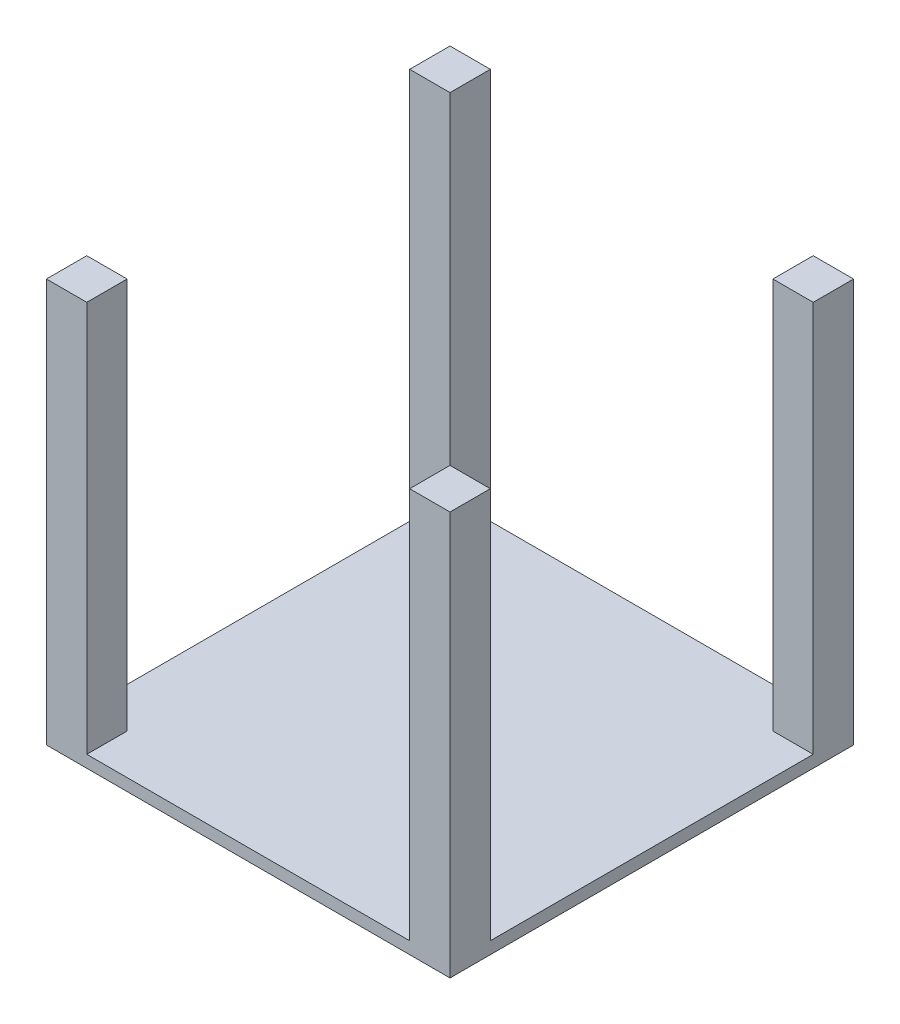
ISO-10303-21;
HEADER;
FILE_DESCRIPTION(('STEP AP214'),'2;1');
FILE_NAME('part.step','',(''),(''),'','','');
FILE_SCHEMA(('AUTOMOTIVE_DESIGN { 1 0 10303 214 1 1 1 1 }'));
ENDSEC;
DATA;
#1=APPLICATION_CONTEXT('core data for automotive mechanical design processes');
#2=APPLICATION_PROTOCOL_DEFINITION('international standard','automotive_design',2000,#1);
#3=PRODUCT_CONTEXT('',#1,'mechanical');
#4=PRODUCT('Part','Part','',(#3));
#5=PRODUCT_RELATED_PRODUCT_CATEGORY('part','',(#4));
#6=PRODUCT_DEFINITION_FORMATION('','',#4);
#7=PRODUCT_DEFINITION_CONTEXT('part definition',#1,'design');
#8=PRODUCT_DEFINITION('design','',#6,#7);
#9=PRODUCT_DEFINITION_SHAPE('','',#8);
#10=(LENGTH_UNIT() NAMED_UNIT(*) SI_UNIT(.MILLI.,.METRE.));
#11=(NAMED_UNIT(*) PLANE_ANGLE_UNIT() SI_UNIT($,.RADIAN.));
#12=(NAMED_UNIT(*) SI_UNIT($,.STERADIAN.) SOLID_ANGLE_UNIT());
#13=UNCERTAINTY_MEASURE_WITH_UNIT(LENGTH_MEASURE(1.E-05),#10,'distance_accuracy_value','');
#14=(GEOMETRIC_REPRESENTATION_CONTEXT(3) GLOBAL_UNCERTAINTY_ASSIGNED_CONTEXT((#13)) GLOBAL_UNIT_ASSIGNED_CONTEXT((#10,
#11,#12)) REPRESENTATION_CONTEXT('',''));
#15=CARTESIAN_POINT('',(0.,0.,0.));
#16=DIRECTION('',(0.,0.,1.));
#17=DIRECTION('',(1.,0.,0.));
#18=AXIS2_PLACEMENT_3D('',#15,#16,#17);
#19=CARTESIAN_POINT('',(0.,30.,500.));
#20=DIRECTION('',(0.,0.,1.));
#21=DIRECTION('',(1.,0.,0.));
#22=AXIS2_PLACEMENT_3D('',#19,#20,#21);
#23=PLANE('',#22);
#24=DIRECTION('',(-1.,0.,0.));
#25=VECTOR('',#24,1.);
#26=CARTESIAN_POINT('',(0.,0.,500.));
#27=LINE('',#26,#25);
#28=CARTESIAN_POINT('',(500.,0.,500.));
#29=VERTEX_POINT('',#28);
#30=CARTESIAN_POINT('',(-500.,0.,500.));
#31=VERTEX_POINT('',#30);
#32=EDGE_CURVE('E157',#29,#31,#27,.T.);
#33=ORIENTED_EDGE('',*,*,#32,.F.);
#34=DIRECTION('',(0.,-1.,0.));
#35=VECTOR('',#34,1.);
#36=CARTESIAN_POINT('',(500.,1000.,500.));
#37=LINE('',#36,#35);
#38=CARTESIAN_POINT('',(500.,1000.,500.));
#39=VERTEX_POINT('',#38);
#40=EDGE_CURVE('E169',#39,#29,#37,.T.);
#41=ORIENTED_EDGE('',*,*,#40,.F.);
#42=DIRECTION('',(-1.,0.,0.));
#43=VECTOR('',#42,1.);
#44=CARTESIAN_POINT('',(500.,1000.,500.));
#45=LINE('',#44,#43);
#46=CARTESIAN_POINT('',(400.,1000.,500.));
#47=VERTEX_POINT('',#46);
#48=EDGE_CURVE('E199',#39,#47,#45,.T.);
#49=ORIENTED_EDGE('',*,*,#48,.T.);
#50=DIRECTION('',(0.,-1.,0.));
#51=VECTOR('',#50,1.);
#52=CARTESIAN_POINT('',(400.,1000.,500.));
#53=LINE('',#52,#51);
#54=CARTESIAN_POINT('',(400.,30.,500.));
#55=VERTEX_POINT('',#54);
#56=EDGE_CURVE('E192',#47,#55,#53,.T.);
#57=ORIENTED_EDGE('',*,*,#56,.T.);
#58=DIRECTION('',(-1.,0.,0.));
#59=VECTOR('',#58,1.);
#60=CARTESIAN_POINT('',(0.,30.,500.));
#61=LINE('',#60,#59);
#62=CARTESIAN_POINT('',(-400.,30.,500.));
#63=VERTEX_POINT('',#62);
#64=EDGE_CURVE('E290',#55,#63,#61,.T.);
#65=ORIENTED_EDGE('',*,*,#64,.T.);
#66=DIRECTION('',(0.,-1.,0.));
#67=VECTOR('',#66,1.);
#68=CARTESIAN_POINT('',(-400.,1000.,500.));
#69=LINE('',#68,#67);
#70=CARTESIAN_POINT('',(-400.,1000.,500.));
#71=VERTEX_POINT('',#70);
#72=EDGE_CURVE('E174',#71,#63,#69,.T.);
#73=ORIENTED_EDGE('',*,*,#72,.F.);
#74=DIRECTION('',(-1.,0.,0.));
#75=VECTOR('',#74,1.);
#76=CARTESIAN_POINT('',(0.,1000.,500.));
#77=LINE('',#76,#75);
#78=CARTESIAN_POINT('',(-500.,1000.,500.));
#79=VERTEX_POINT('',#78);
#80=EDGE_CURVE('E260',#71,#79,#77,.T.);
#81=ORIENTED_EDGE('',*,*,#80,.T.);
#82=DIRECTION('',(0.,-1.,0.));
#83=VECTOR('',#82,1.);
#84=CARTESIAN_POINT('',(-500.,1000.,500.));
#85=LINE('',#84,#83);
#86=EDGE_CURVE('E172',#79,#31,#85,.T.);
#87=ORIENTED_EDGE('',*,*,#86,.T.);
#88=EDGE_LOOP('',(#33,#41,#49,#57,#65,#73,#81,#87));
#89=FACE_BOUND('',#88,.T.);
#90=ADVANCED_FACE('F43',(#89),#23,.T.);
#91=CARTESIAN_POINT('',(500.,30.,0.));
#92=DIRECTION('',(-1.,0.,0.));
#93=DIRECTION('',(0.,0.,1.));
#94=AXIS2_PLACEMENT_3D('',#91,#92,#93);
#95=PLANE('',#94);
#96=DIRECTION('',(0.,0.,-1.));
#97=VECTOR('',#96,1.);
#98=CARTESIAN_POINT('',(500.,0.,0.));
#99=LINE('',#98,#97);
#100=CARTESIAN_POINT('',(500.,0.,-500.));
#101=VERTEX_POINT('',#100);
#102=EDGE_CURVE('E153',#29,#101,#99,.T.);
#103=ORIENTED_EDGE('',*,*,#102,.T.);
#104=DIRECTION('',(0.,-1.,0.));
#105=VECTOR('',#104,1.);
#106=CARTESIAN_POINT('',(500.,1000.,-500.));
#107=LINE('',#106,#105);
#108=CARTESIAN_POINT('',(500.,1000.,-500.));
#109=VERTEX_POINT('',#108);
#110=EDGE_CURVE('E214',#109,#101,#107,.T.);
#111=ORIENTED_EDGE('',*,*,#110,.F.);
#112=DIRECTION('',(0.,0.,-1.));
#113=VECTOR('',#112,1.);
#114=CARTESIAN_POINT('',(500.,1000.,0.));
#115=LINE('',#114,#113);
#116=CARTESIAN_POINT('',(500.,1000.,-400.));
#117=VERTEX_POINT('',#116);
#118=EDGE_CURVE('E217',#117,#109,#115,.T.);
#119=ORIENTED_EDGE('',*,*,#118,.F.);
#120=DIRECTION('',(0.,-1.,0.));
#121=VECTOR('',#120,1.);
#122=CARTESIAN_POINT('',(500.,1000.,-400.));
#123=LINE('',#122,#121);
#124=CARTESIAN_POINT('',(500.,30.,-400.));
#125=VERTEX_POINT('',#124);
#126=EDGE_CURVE('E210',#117,#125,#123,.T.);
#127=ORIENTED_EDGE('',*,*,#126,.T.);
#128=DIRECTION('',(0.,0.,-1.));
#129=VECTOR('',#128,1.);
#130=CARTESIAN_POINT('',(500.,30.,0.));
#131=LINE('',#130,#129);
#132=CARTESIAN_POINT('',(500.,30.,400.));
#133=VERTEX_POINT('',#132);
#134=EDGE_CURVE('E301',#133,#125,#131,.T.);
#135=ORIENTED_EDGE('',*,*,#134,.F.);
#136=DIRECTION('',(0.,-1.,0.));
#137=VECTOR('',#136,1.);
#138=CARTESIAN_POINT('',(500.,1000.,400.));
#139=LINE('',#138,#137);
#140=CARTESIAN_POINT('',(500.,1000.,400.));
#141=VERTEX_POINT('',#140);
#142=EDGE_CURVE('E181',#141,#133,#139,.T.);
#143=ORIENTED_EDGE('',*,*,#142,.F.);
#144=DIRECTION('',(0.,0.,-1.));
#145=VECTOR('',#144,1.);
#146=CARTESIAN_POINT('',(500.,1000.,500.));
#147=LINE('',#146,#145);
#148=EDGE_CURVE('E178',#39,#141,#147,.T.);
#149=ORIENTED_EDGE('',*,*,#148,.F.);
#150=ORIENTED_EDGE('',*,*,#40,.T.);
#151=EDGE_LOOP('',(#103,#111,#119,#127,#135,#143,#149,#150));
#152=FACE_BOUND('',#151,.T.);
#153=ADVANCED_FACE('F176',(#152),#95,.F.);
#154=CARTESIAN_POINT('',(0.,30.,-500.));
#155=DIRECTION('',(0.,0.,1.));
#156=DIRECTION('',(1.,0.,0.));
#157=AXIS2_PLACEMENT_3D('',#154,#155,#156);
#158=PLANE('',#157);
#159=DIRECTION('',(-1.,0.,0.));
#160=VECTOR('',#159,1.);
#161=CARTESIAN_POINT('',(0.,0.,-500.));
#162=LINE('',#161,#160);
#163=CARTESIAN_POINT('',(-500.,0.,-500.));
#164=VERTEX_POINT('',#163);
#165=EDGE_CURVE('E159',#101,#164,#162,.T.);
#166=ORIENTED_EDGE('',*,*,#165,.T.);
#167=DIRECTION('',(0.,-1.,0.));
#168=VECTOR('',#167,1.);
#169=CARTESIAN_POINT('',(-500.,1000.,-500.));
#170=LINE('',#169,#168);
#171=CARTESIAN_POINT('',(-500.,1000.,-500.));
#172=VERTEX_POINT('',#171);
#173=EDGE_CURVE('E235',#172,#164,#170,.T.);
#174=ORIENTED_EDGE('',*,*,#173,.F.);
#175=DIRECTION('',(-1.,0.,0.));
#176=VECTOR('',#175,1.);
#177=CARTESIAN_POINT('',(0.,1000.,-500.));
#178=LINE('',#177,#176);
#179=CARTESIAN_POINT('',(-400.,1000.,-500.));
#180=VERTEX_POINT('',#179);
#181=EDGE_CURVE('E253',#180,#172,#178,.T.);
#182=ORIENTED_EDGE('',*,*,#181,.F.);
#183=DIRECTION('',(0.,-1.,0.));
#184=VECTOR('',#183,1.);
#185=CARTESIAN_POINT('',(-400.,1000.,-500.));
#186=LINE('',#185,#184);
#187=CARTESIAN_POINT('',(-400.,30.,-500.));
#188=VERTEX_POINT('',#187);
#189=EDGE_CURVE('E231',#180,#188,#186,.T.);
#190=ORIENTED_EDGE('',*,*,#189,.T.);
#191=DIRECTION('',(-1.,0.,0.));
#192=VECTOR('',#191,1.);
#193=CARTESIAN_POINT('',(0.,30.,-500.));
#194=LINE('',#193,#192);
#195=CARTESIAN_POINT('',(400.,30.,-500.));
#196=VERTEX_POINT('',#195);
#197=EDGE_CURVE('E311',#196,#188,#194,.T.);
#198=ORIENTED_EDGE('',*,*,#197,.F.);
#199=DIRECTION('',(0.,-1.,0.));
#200=VECTOR('',#199,1.);
#201=CARTESIAN_POINT('',(400.,1000.,-500.));
#202=LINE('',#201,#200);
#203=CARTESIAN_POINT('',(400.,1000.,-500.));
#204=VERTEX_POINT('',#203);
#205=EDGE_CURVE('E202',#204,#196,#202,.T.);
#206=ORIENTED_EDGE('',*,*,#205,.F.);
#207=DIRECTION('',(-1.,0.,0.));
#208=VECTOR('',#207,1.);
#209=CARTESIAN_POINT('',(0.,1000.,-500.));
#210=LINE('',#209,#208);
#211=EDGE_CURVE('E227',#109,#204,#210,.T.);
#212=ORIENTED_EDGE('',*,*,#211,.F.);
#213=ORIENTED_EDGE('',*,*,#110,.T.);
#214=EDGE_LOOP('',(#166,#174,#182,#190,#198,#206,#212,#213));
#215=FACE_BOUND('',#214,.T.);
#216=ADVANCED_FACE('F331',(#215),#158,.F.);
#217=CARTESIAN_POINT('',(-500.,30.,0.));
#218=DIRECTION('',(-1.,0.,0.));
#219=DIRECTION('',(0.,0.,1.));
#220=AXIS2_PLACEMENT_3D('',#217,#218,#219);
#221=PLANE('',#220);
#222=DIRECTION('',(0.,0.,-1.));
#223=VECTOR('',#222,1.);
#224=CARTESIAN_POINT('',(-500.,0.,0.));
#225=LINE('',#224,#223);
#226=EDGE_CURVE('E46',#31,#164,#225,.T.);
#227=ORIENTED_EDGE('',*,*,#226,.F.);
#228=ORIENTED_EDGE('',*,*,#86,.F.);
#229=DIRECTION('',(0.,0.,-1.));
#230=VECTOR('',#229,1.);
#231=CARTESIAN_POINT('',(-500.,1000.,0.));
#232=LINE('',#231,#230);
#233=CARTESIAN_POINT('',(-500.,1000.,400.));
#234=VERTEX_POINT('',#233);
#235=EDGE_CURVE('E270',#79,#234,#232,.T.);
#236=ORIENTED_EDGE('',*,*,#235,.T.);
#237=DIRECTION('',(0.,-1.,0.));
#238=VECTOR('',#237,1.);
#239=CARTESIAN_POINT('',(-500.,1000.,400.));
#240=LINE('',#239,#238);
#241=CARTESIAN_POINT('',(-500.,30.,400.));
#242=VERTEX_POINT('',#241);
#243=EDGE_CURVE('E276',#234,#242,#240,.T.);
#244=ORIENTED_EDGE('',*,*,#243,.T.);
#245=DIRECTION('',(0.,0.,-1.));
#246=VECTOR('',#245,1.);
#247=CARTESIAN_POINT('',(-500.,30.,0.));
#248=LINE('',#247,#246);
#249=CARTESIAN_POINT('',(-500.,30.,-400.));
#250=VERTEX_POINT('',#249);
#251=EDGE_CURVE('E52',#242,#250,#248,.T.);
#252=ORIENTED_EDGE('',*,*,#251,.T.);
#253=DIRECTION('',(0.,-1.,0.));
#254=VECTOR('',#253,1.);
#255=CARTESIAN_POINT('',(-500.,1000.,-400.));
#256=LINE('',#255,#254);
#257=CARTESIAN_POINT('',(-500.,1000.,-400.));
#258=VERTEX_POINT('',#257);
#259=EDGE_CURVE('E239',#258,#250,#256,.T.);
#260=ORIENTED_EDGE('',*,*,#259,.F.);
#261=DIRECTION('',(0.,0.,-1.));
#262=VECTOR('',#261,1.);
#263=CARTESIAN_POINT('',(-500.,1000.,0.));
#264=LINE('',#263,#262);
#265=EDGE_CURVE('E249',#258,#172,#264,.T.);
#266=ORIENTED_EDGE('',*,*,#265,.T.);
#267=ORIENTED_EDGE('',*,*,#173,.T.);
#268=EDGE_LOOP('',(#227,#228,#236,#244,#252,#260,#266,#267));
#269=FACE_BOUND('',#268,.T.);
#270=ADVANCED_FACE('F328',(#269),#221,.T.);
#271=CARTESIAN_POINT('',(0.,30.,0.));
#272=DIRECTION('',(0.,1.,0.));
#273=DIRECTION('',(0.,0.,1.));
#274=AXIS2_PLACEMENT_3D('',#271,#272,#273);
#275=PLANE('',#274);
#276=DIRECTION('',(0.,0.,-1.));
#277=VECTOR('',#276,1.);
#278=CARTESIAN_POINT('',(-400.,30.,4.44089209850063E-13));
#279=LINE('',#278,#277);
#280=CARTESIAN_POINT('',(-400.,30.,400.));
#281=VERTEX_POINT('',#280);
#282=EDGE_CURVE('E287',#63,#281,#279,.T.);
#283=ORIENTED_EDGE('',*,*,#282,.F.);
#284=ORIENTED_EDGE('',*,*,#64,.F.);
#285=DIRECTION('',(0.,0.,-1.));
#286=VECTOR('',#285,1.);
#287=CARTESIAN_POINT('',(400.,30.,0.));
#288=LINE('',#287,#286);
#289=CARTESIAN_POINT('',(400.,30.,400.));
#290=VERTEX_POINT('',#289);
#291=EDGE_CURVE('E294',#55,#290,#288,.T.);
#292=ORIENTED_EDGE('',*,*,#291,.T.);
#293=DIRECTION('',(-1.,0.,0.));
#294=VECTOR('',#293,1.);
#295=CARTESIAN_POINT('',(0.,30.,400.));
#296=LINE('',#295,#294);
#297=EDGE_CURVE('E297',#133,#290,#296,.T.);
#298=ORIENTED_EDGE('',*,*,#297,.F.);
#299=ORIENTED_EDGE('',*,*,#134,.T.);
#300=DIRECTION('',(-1.,0.,0.));
#301=VECTOR('',#300,1.);
#302=CARTESIAN_POINT('',(0.,30.,-400.));
#303=LINE('',#302,#301);
#304=CARTESIAN_POINT('',(400.,30.,-400.));
#305=VERTEX_POINT('',#304);
#306=EDGE_CURVE('E304',#125,#305,#303,.T.);
#307=ORIENTED_EDGE('',*,*,#306,.T.);
#308=DIRECTION('',(0.,0.,1.));
#309=VECTOR('',#308,1.);
#310=CARTESIAN_POINT('',(400.,30.,-2.22044604925031E-13));
#311=LINE('',#310,#309);
#312=EDGE_CURVE('E307',#196,#305,#311,.T.);
#313=ORIENTED_EDGE('',*,*,#312,.F.);
#314=ORIENTED_EDGE('',*,*,#197,.T.);
#315=DIRECTION('',(0.,0.,1.));
#316=VECTOR('',#315,1.);
#317=CARTESIAN_POINT('',(-400.,30.,0.));
#318=LINE('',#317,#316);
#319=CARTESIAN_POINT('',(-400.,30.,-400.));
#320=VERTEX_POINT('',#319);
#321=EDGE_CURVE('E315',#188,#320,#318,.T.);
#322=ORIENTED_EDGE('',*,*,#321,.T.);
#323=DIRECTION('',(1.,0.,0.));
#324=VECTOR('',#323,1.);
#325=CARTESIAN_POINT('',(0.,30.,-400.));
#326=LINE('',#325,#324);
#327=EDGE_CURVE('E319',#250,#320,#326,.T.);
#328=ORIENTED_EDGE('',*,*,#327,.F.);
#329=ORIENTED_EDGE('',*,*,#251,.F.);
#330=DIRECTION('',(1.,0.,0.));
#331=VECTOR('',#330,1.);
#332=CARTESIAN_POINT('',(0.,30.,400.));
#333=LINE('',#332,#331);
#334=EDGE_CURVE('E11',#242,#281,#333,.T.);
#335=ORIENTED_EDGE('',*,*,#334,.T.);
#336=EDGE_LOOP('',(#283,#284,#292,#298,#299,#307,#313,#314,#322,#328,#329,#335));
#337=FACE_BOUND('',#336,.T.);
#338=ADVANCED_FACE('F339',(#337),#275,.T.);
#339=CARTESIAN_POINT('',(0.,0.,0.));
#340=DIRECTION('',(0.,1.,0.));
#341=DIRECTION('',(0.,0.,1.));
#342=AXIS2_PLACEMENT_3D('',#339,#340,#341);
#343=PLANE('',#342);
#344=ORIENTED_EDGE('',*,*,#32,.T.);
#345=ORIENTED_EDGE('',*,*,#226,.T.);
#346=ORIENTED_EDGE('',*,*,#165,.F.);
#347=ORIENTED_EDGE('',*,*,#102,.F.);
#348=EDGE_LOOP('',(#344,#345,#346,#347));
#349=FACE_BOUND('',#348,.T.);
#350=ADVANCED_FACE('F155',(#349),#343,.F.);
#351=CARTESIAN_POINT('',(-400.,1000.,4.44089209850063E-13));
#352=DIRECTION('',(-1.,0.,0.));
#353=DIRECTION('',(0.,0.,1.));
#354=AXIS2_PLACEMENT_3D('',#351,#352,#353);
#355=PLANE('',#354);
#356=ORIENTED_EDGE('',*,*,#282,.T.);
#357=DIRECTION('',(0.,-1.,0.));
#358=VECTOR('',#357,1.);
#359=CARTESIAN_POINT('',(-400.,1000.,400.));
#360=LINE('',#359,#358);
#361=CARTESIAN_POINT('',(-400.,1000.,400.));
#362=VERTEX_POINT('',#361);
#363=EDGE_CURVE('E280',#362,#281,#360,.T.);
#364=ORIENTED_EDGE('',*,*,#363,.F.);
#365=DIRECTION('',(0.,0.,-1.));
#366=VECTOR('',#365,1.);
#367=CARTESIAN_POINT('',(-400.,1000.,4.44089209850063E-13));
#368=LINE('',#367,#366);
#369=EDGE_CURVE('E263',#71,#362,#368,.T.);
#370=ORIENTED_EDGE('',*,*,#369,.F.);
#371=ORIENTED_EDGE('',*,*,#72,.T.);
#372=EDGE_LOOP('',(#356,#364,#370,#371));
#373=FACE_BOUND('',#372,.T.);
#374=ADVANCED_FACE('F390',(#373),#355,.F.);
#375=CARTESIAN_POINT('',(0.,1000.,400.));
#376=DIRECTION('',(0.,0.,-1.));
#377=DIRECTION('',(-1.,0.,0.));
#378=AXIS2_PLACEMENT_3D('',#375,#376,#377);
#379=PLANE('',#378);
#380=ORIENTED_EDGE('',*,*,#363,.T.);
#381=ORIENTED_EDGE('',*,*,#334,.F.);
#382=ORIENTED_EDGE('',*,*,#243,.F.);
#383=DIRECTION('',(1.,0.,0.));
#384=VECTOR('',#383,1.);
#385=CARTESIAN_POINT('',(0.,1000.,400.));
#386=LINE('',#385,#384);
#387=EDGE_CURVE('E266',#234,#362,#386,.T.);
#388=ORIENTED_EDGE('',*,*,#387,.T.);
#389=EDGE_LOOP('',(#380,#381,#382,#388));
#390=FACE_BOUND('',#389,.T.);
#391=ADVANCED_FACE('F395',(#390),#379,.T.);
#392=CARTESIAN_POINT('',(0.,1000.,0.));
#393=DIRECTION('',(0.,1.,0.));
#394=DIRECTION('',(0.,0.,1.));
#395=AXIS2_PLACEMENT_3D('',#392,#393,#394);
#396=PLANE('',#395);
#397=ORIENTED_EDGE('',*,*,#80,.F.);
#398=ORIENTED_EDGE('',*,*,#369,.T.);
#399=ORIENTED_EDGE('',*,*,#387,.F.);
#400=ORIENTED_EDGE('',*,*,#235,.F.);
#401=EDGE_LOOP('',(#397,#398,#399,#400));
#402=FACE_BOUND('',#401,.T.);
#403=ADVANCED_FACE('F399',(#402),#396,.T.);
#404=CARTESIAN_POINT('',(-400.,1000.,0.));
#405=DIRECTION('',(1.,0.,0.));
#406=DIRECTION('',(0.,0.,-1.));
#407=AXIS2_PLACEMENT_3D('',#404,#405,#406);
#408=PLANE('',#407);
#409=DIRECTION('',(0.,-1.,0.));
#410=VECTOR('',#409,1.);
#411=CARTESIAN_POINT('',(-400.,1000.,-400.));
#412=LINE('',#411,#410);
#413=CARTESIAN_POINT('',(-400.,1000.,-400.));
#414=VERTEX_POINT('',#413);
#415=EDGE_CURVE('E242',#414,#320,#412,.T.);
#416=ORIENTED_EDGE('',*,*,#415,.T.);
#417=ORIENTED_EDGE('',*,*,#321,.F.);
#418=ORIENTED_EDGE('',*,*,#189,.F.);
#419=DIRECTION('',(0.,0.,1.));
#420=VECTOR('',#419,1.);
#421=CARTESIAN_POINT('',(-400.,1000.,0.));
#422=LINE('',#421,#420);
#423=EDGE_CURVE('E256',#180,#414,#422,.T.);
#424=ORIENTED_EDGE('',*,*,#423,.T.);
#425=EDGE_LOOP('',(#416,#417,#418,#424));
#426=FACE_BOUND('',#425,.T.);
#427=ADVANCED_FACE('F338',(#426),#408,.T.);
#428=CARTESIAN_POINT('',(0.,1000.,-400.));
#429=DIRECTION('',(0.,0.,-1.));
#430=DIRECTION('',(-1.,0.,0.));
#431=AXIS2_PLACEMENT_3D('',#428,#429,#430);
#432=PLANE('',#431);
#433=ORIENTED_EDGE('',*,*,#327,.T.);
#434=ORIENTED_EDGE('',*,*,#415,.F.);
#435=DIRECTION('',(1.,0.,0.));
#436=VECTOR('',#435,1.);
#437=CARTESIAN_POINT('',(0.,1000.,-400.));
#438=LINE('',#437,#436);
#439=EDGE_CURVE('E246',#258,#414,#438,.T.);
#440=ORIENTED_EDGE('',*,*,#439,.F.);
#441=ORIENTED_EDGE('',*,*,#259,.T.);
#442=EDGE_LOOP('',(#433,#434,#440,#441));
#443=FACE_BOUND('',#442,.T.);
#444=ADVANCED_FACE('F406',(#443),#432,.F.);
#445=CARTESIAN_POINT('',(0.,1000.,0.));
#446=DIRECTION('',(0.,1.,0.));
#447=DIRECTION('',(0.,0.,1.));
#448=AXIS2_PLACEMENT_3D('',#445,#446,#447);
#449=PLANE('',#448);
#450=ORIENTED_EDGE('',*,*,#423,.F.);
#451=ORIENTED_EDGE('',*,*,#181,.T.);
#452=ORIENTED_EDGE('',*,*,#265,.F.);
#453=ORIENTED_EDGE('',*,*,#439,.T.);
#454=EDGE_LOOP('',(#450,#451,#452,#453));
#455=FACE_BOUND('',#454,.T.);
#456=ADVANCED_FACE('F334',(#455),#449,.T.);
#457=CARTESIAN_POINT('',(400.,1000.,-2.22044604925031E-13));
#458=DIRECTION('',(1.,0.,0.));
#459=DIRECTION('',(0.,0.,-1.));
#460=AXIS2_PLACEMENT_3D('',#457,#458,#459);
#461=PLANE('',#460);
#462=ORIENTED_EDGE('',*,*,#312,.T.);
#463=DIRECTION('',(0.,-1.,0.));
#464=VECTOR('',#463,1.);
#465=CARTESIAN_POINT('',(400.,1000.,-400.));
#466=LINE('',#465,#464);
#467=CARTESIAN_POINT('',(400.,1000.,-400.));
#468=VERTEX_POINT('',#467);
#469=EDGE_CURVE('E206',#468,#305,#466,.T.);
#470=ORIENTED_EDGE('',*,*,#469,.F.);
#471=DIRECTION('',(0.,0.,1.));
#472=VECTOR('',#471,1.);
#473=CARTESIAN_POINT('',(400.,1000.,-2.22044604925031E-13));
#474=LINE('',#473,#472);
#475=EDGE_CURVE('E224',#204,#468,#474,.T.);
#476=ORIENTED_EDGE('',*,*,#475,.F.);
#477=ORIENTED_EDGE('',*,*,#205,.T.);
#478=EDGE_LOOP('',(#462,#470,#476,#477));
#479=FACE_BOUND('',#478,.T.);
#480=ADVANCED_FACE('F344',(#479),#461,.F.);
#481=CARTESIAN_POINT('',(0.,1000.,-400.));
#482=DIRECTION('',(0.,0.,1.));
#483=DIRECTION('',(1.,0.,0.));
#484=AXIS2_PLACEMENT_3D('',#481,#482,#483);
#485=PLANE('',#484);
#486=ORIENTED_EDGE('',*,*,#469,.T.);
#487=ORIENTED_EDGE('',*,*,#306,.F.);
#488=ORIENTED_EDGE('',*,*,#126,.F.);
#489=DIRECTION('',(-1.,0.,0.));
#490=VECTOR('',#489,1.);
#491=CARTESIAN_POINT('',(0.,1000.,-400.));
#492=LINE('',#491,#490);
#493=EDGE_CURVE('E220',#117,#468,#492,.T.);
#494=ORIENTED_EDGE('',*,*,#493,.T.);
#495=EDGE_LOOP('',(#486,#487,#488,#494));
#496=FACE_BOUND('',#495,.T.);
#497=ADVANCED_FACE('F353',(#496),#485,.T.);
#498=CARTESIAN_POINT('',(0.,1000.,0.));
#499=DIRECTION('',(0.,1.,0.));
#500=DIRECTION('',(0.,0.,1.));
#501=AXIS2_PLACEMENT_3D('',#498,#499,#500);
#502=PLANE('',#501);
#503=ORIENTED_EDGE('',*,*,#211,.T.);
#504=ORIENTED_EDGE('',*,*,#475,.T.);
#505=ORIENTED_EDGE('',*,*,#493,.F.);
#506=ORIENTED_EDGE('',*,*,#118,.T.);
#507=EDGE_LOOP('',(#503,#504,#505,#506));
#508=FACE_BOUND('',#507,.T.);
#509=ADVANCED_FACE('F348',(#508),#502,.T.);
#510=CARTESIAN_POINT('',(500.,1000.,400.));
#511=DIRECTION('',(0.,0.,1.));
#512=DIRECTION('',(1.,0.,0.));
#513=AXIS2_PLACEMENT_3D('',#510,#511,#512);
#514=PLANE('',#513);
#515=ORIENTED_EDGE('',*,*,#297,.T.);
#516=DIRECTION('',(0.,-1.,0.));
#517=VECTOR('',#516,1.);
#518=CARTESIAN_POINT('',(400.,1000.,400.));
#519=LINE('',#518,#517);
#520=CARTESIAN_POINT('',(400.,1000.,400.));
#521=VERTEX_POINT('',#520);
#522=EDGE_CURVE('E185',#521,#290,#519,.T.);
#523=ORIENTED_EDGE('',*,*,#522,.F.);
#524=DIRECTION('',(-1.,0.,0.));
#525=VECTOR('',#524,1.);
#526=CARTESIAN_POINT('',(500.,1000.,400.));
#527=LINE('',#526,#525);
#528=EDGE_CURVE('E191',#141,#521,#527,.T.);
#529=ORIENTED_EDGE('',*,*,#528,.F.);
#530=ORIENTED_EDGE('',*,*,#142,.T.);
#531=EDGE_LOOP('',(#515,#523,#529,#530));
#532=FACE_BOUND('',#531,.T.);
#533=ADVANCED_FACE('F359',(#532),#514,.F.);
#534=CARTESIAN_POINT('',(400.,1000.,500.));
#535=DIRECTION('',(-1.,0.,0.));
#536=DIRECTION('',(0.,0.,1.));
#537=AXIS2_PLACEMENT_3D('',#534,#535,#536);
#538=PLANE('',#537);
#539=ORIENTED_EDGE('',*,*,#522,.T.);
#540=ORIENTED_EDGE('',*,*,#291,.F.);
#541=ORIENTED_EDGE('',*,*,#56,.F.);
#542=DIRECTION('',(0.,0.,-1.));
#543=VECTOR('',#542,1.);
#544=CARTESIAN_POINT('',(400.,1000.,500.));
#545=LINE('',#544,#543);
#546=EDGE_CURVE('E195',#47,#521,#545,.T.);
#547=ORIENTED_EDGE('',*,*,#546,.T.);
#548=EDGE_LOOP('',(#539,#540,#541,#547));
#549=FACE_BOUND('',#548,.T.);
#550=ADVANCED_FACE('F368',(#549),#538,.T.);
#551=CARTESIAN_POINT('',(0.,1000.,0.));
#552=DIRECTION('',(0.,-1.,0.));
#553=DIRECTION('',(0.,0.,-1.));
#554=AXIS2_PLACEMENT_3D('',#551,#552,#553);
#555=PLANE('',#554);
#556=ORIENTED_EDGE('',*,*,#48,.F.);
#557=ORIENTED_EDGE('',*,*,#148,.T.);
#558=ORIENTED_EDGE('',*,*,#528,.T.);
#559=ORIENTED_EDGE('',*,*,#546,.F.);
#560=EDGE_LOOP('',(#556,#557,#558,#559));
#561=FACE_BOUND('',#560,.T.);
#562=ADVANCED_FACE('F362',(#561),#555,.F.);
#563=CLOSED_SHELL('',(#90,#153,#216,#270,#338,#350,#374,#391,#403,#427,#444,#456,#480,#497,#509,
#533,#550,#562));
#564=MANIFOLD_SOLID_BREP('B2',#563);
#565=ADVANCED_BREP_SHAPE_REPRESENTATION('',(#18,#564),#14);
#566=SHAPE_DEFINITION_REPRESENTATION(#9,#565);
ENDSEC;
END-ISO-10303-21;
